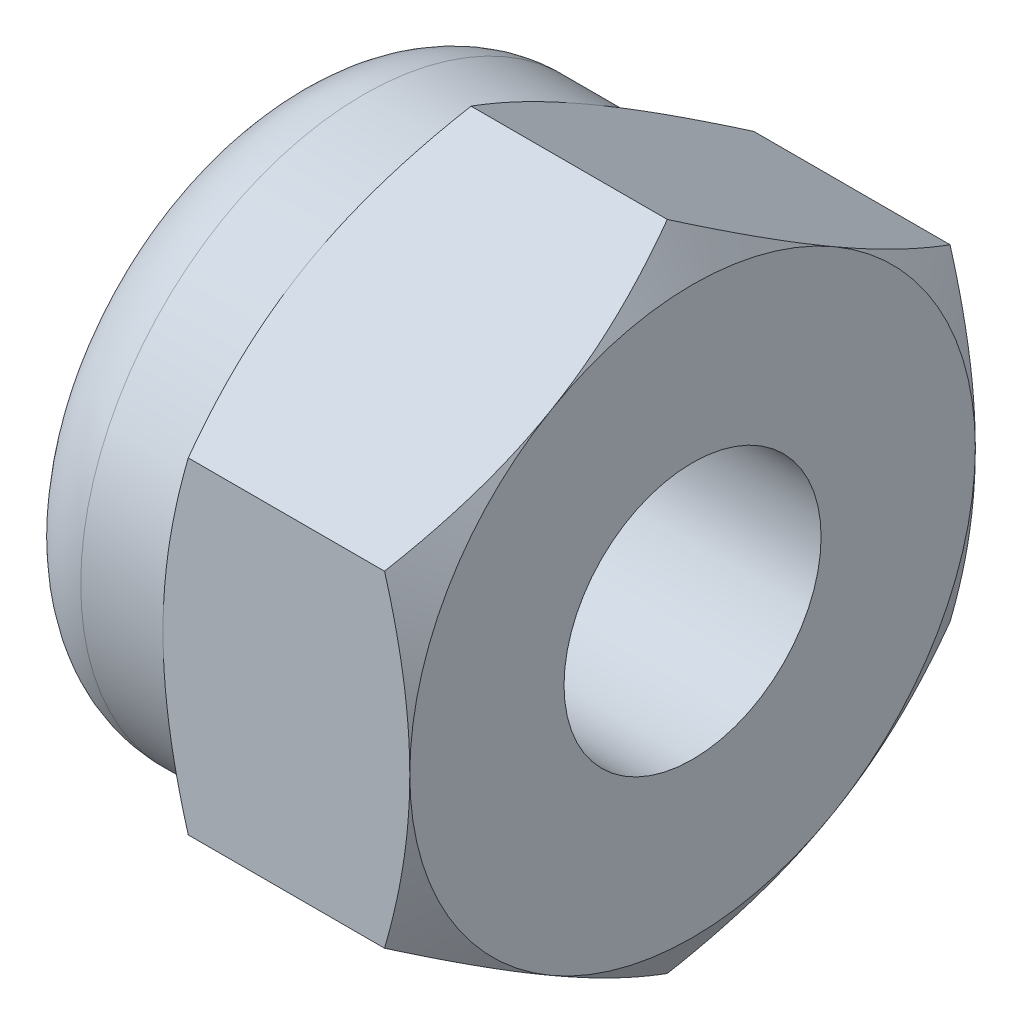
ISO-10303-21;
HEADER;
FILE_DESCRIPTION(('STEP AP214'),'2;1');
FILE_NAME('part.step','',(''),(''),'','','');
FILE_SCHEMA(('AUTOMOTIVE_DESIGN { 1 0 10303 214 1 1 1 1 }'));
ENDSEC;
DATA;
#1=APPLICATION_CONTEXT('core data for automotive mechanical design processes');
#2=APPLICATION_PROTOCOL_DEFINITION('international standard','automotive_design',2000,#1);
#3=PRODUCT_CONTEXT('',#1,'mechanical');
#4=PRODUCT('Part','Part','',(#3));
#5=PRODUCT_RELATED_PRODUCT_CATEGORY('part','',(#4));
#6=PRODUCT_DEFINITION_FORMATION('','',#4);
#7=PRODUCT_DEFINITION_CONTEXT('part definition',#1,'design');
#8=PRODUCT_DEFINITION('design','',#6,#7);
#9=PRODUCT_DEFINITION_SHAPE('','',#8);
#10=(LENGTH_UNIT() NAMED_UNIT(*) SI_UNIT(.MILLI.,.METRE.));
#11=(NAMED_UNIT(*) PLANE_ANGLE_UNIT() SI_UNIT($,.RADIAN.));
#12=(NAMED_UNIT(*) SI_UNIT($,.STERADIAN.) SOLID_ANGLE_UNIT());
#13=UNCERTAINTY_MEASURE_WITH_UNIT(LENGTH_MEASURE(1.E-05),#10,'distance_accuracy_value','');
#14=(GEOMETRIC_REPRESENTATION_CONTEXT(3) GLOBAL_UNCERTAINTY_ASSIGNED_CONTEXT((#13)) GLOBAL_UNIT_ASSIGNED_CONTEXT((#10,
#11,#12)) REPRESENTATION_CONTEXT('',''));
#15=CARTESIAN_POINT('',(0.,0.,0.));
#16=DIRECTION('',(0.,0.,1.));
#17=DIRECTION('',(1.,0.,0.));
#18=AXIS2_PLACEMENT_3D('',#15,#16,#17);
#19=CARTESIAN_POINT('',(-4.,1.58771324027147,-2.75));
#20=DIRECTION('',(0.,0.866025403784439,-0.5));
#21=DIRECTION('',(0.,0.5,0.866025403784439));
#22=AXIS2_PLACEMENT_3D('',#19,#20,#21);
#23=PLANE('',#22);
#24=DIRECTION('',(1.,0.,0.));
#25=VECTOR('',#24,1.);
#26=CARTESIAN_POINT('',(-4.,1.58771324027147,-2.75));
#27=LINE('',#26,#25);
#28=CARTESIAN_POINT('',(-2.15437990693814,1.58771324027148,-2.75));
#29=VERTEX_POINT('',#28);
#30=CARTESIAN_POINT('',(-0.245620093061859,1.58771324027148,-2.75));
#31=VERTEX_POINT('',#30);
#32=EDGE_CURVE('E143',#29,#31,#27,.T.);
#33=ORIENTED_EDGE('',*,*,#32,.F.);
#34=CARTESIAN_POINT('',(-2.15431323663524,1.58759777021763,-2.7502));
#35=CARTESIAN_POINT('',(-2.19461233775074,1.65737010029699,-2.62935077934009));
#36=CARTESIAN_POINT('',(-2.23126309740234,1.72774469983534,-2.50745839737737));
#37=CARTESIAN_POINT('',(-2.2952378170302,1.86971254687003,-2.26156287327211));
#38=CARTESIAN_POINT('',(-2.3225391443255,1.94130831721583,-2.13755536142614));
#39=CARTESIAN_POINT('',(-2.36503825470588,2.08361254889599,-1.89107720202406));
#40=CARTESIAN_POINT('',(-2.38051888137754,2.15429911309865,-1.76864448141258));
#41=CARTESIAN_POINT('',(-2.39900060263006,2.29600490065923,-1.52320285763108));
#42=CARTESIAN_POINT('',(-2.4020170005374,2.36702360884404,-1.40019484676709));
#43=CARTESIAN_POINT('',(-2.39574685457146,2.49972966594897,-1.17034121338921));
#44=CARTESIAN_POINT('',(-2.3879998457233,2.56143686540073,-1.06346120874598));
#45=CARTESIAN_POINT('',(-2.36344481893564,2.68444923614047,-0.850397532665252));
#46=CARTESIAN_POINT('',(-2.34662841034943,2.74575398185008,-0.744214598351112));
#47=CARTESIAN_POINT('',(-2.30458807765404,2.86902004703207,-0.530711510606817));
#48=CARTESIAN_POINT('',(-2.27918591931277,2.93096576264319,-0.423418383857147));
#49=CARTESIAN_POINT('',(-2.22153277416002,3.05393320806134,-0.21043252071595));
#50=CARTESIAN_POINT('',(-2.18929533670102,3.11495651365995,-0.104737054973348));
#51=CARTESIAN_POINT('',(-2.15431323663524,3.17554195059678,0.000200000000000793));
#52=B_SPLINE_CURVE_WITH_KNOTS('',3,(#34,#35,#36,#37,#38,#39,#40,#41,#42,#43,#44,#45,#46,#47,#48,
#49,#50,#51),.UNSPECIFIED.,.F.,.F.,(4,2,2,2,2,2,2,2,4),(0.,0.435912828725887,0.872873557116331,
1.29901931904671,1.72464171213573,2.09526089052937,2.46622354066374,2.84541551798557,
3.22386274754524),.UNSPECIFIED.);
#53=CARTESIAN_POINT('',(-2.4,2.38156986040721,-1.375));
#54=VERTEX_POINT('',#53);
#55=EDGE_CURVE('E263',#29,#54,#52,.T.);
#56=ORIENTED_EDGE('',*,*,#55,.T.);
#57=CARTESIAN_POINT('',(-2.15437990693814,3.17542648054295,0.));
#58=VERTEX_POINT('',#57);
#59=EDGE_CURVE('E257',#54,#58,#52,.T.);
#60=ORIENTED_EDGE('',*,*,#59,.T.);
#61=DIRECTION('',(1.,0.,0.));
#62=VECTOR('',#61,1.);
#63=CARTESIAN_POINT('',(-4.,3.17542648054295,0.));
#64=LINE('',#63,#62);
#65=CARTESIAN_POINT('',(-0.245620093061859,3.17542648054295,0.));
#66=VERTEX_POINT('',#65);
#67=EDGE_CURVE('E150',#58,#66,#64,.T.);
#68=ORIENTED_EDGE('',*,*,#67,.T.);
#69=CARTESIAN_POINT('',(-0.245686763364757,3.17554195059678,0.000200000000000731));
#70=CARTESIAN_POINT('',(-0.20538766224926,3.10576962051743,-0.120649220659906));
#71=CARTESIAN_POINT('',(-0.16873690259766,3.03539502097908,-0.242541602622634));
#72=CARTESIAN_POINT('',(-0.104762182969799,2.89342717394439,-0.488437126727894));
#73=CARTESIAN_POINT('',(-0.0774608556744963,2.82183140359859,-0.612444638573856));
#74=CARTESIAN_POINT('',(-0.0349617452941165,2.67952717191843,-0.858922797975944));
#75=CARTESIAN_POINT('',(-0.0194811186224578,2.60884060771578,-0.981355518587418));
#76=CARTESIAN_POINT('',(-0.000999397369940394,2.46713482015519,-1.22679714236892));
#77=CARTESIAN_POINT('',(0.00201700053740085,2.39611611197038,-1.34980515323291));
#78=CARTESIAN_POINT('',(-0.0042531454285459,2.26341005486545,-1.57965878661079));
#79=CARTESIAN_POINT('',(-0.0120001542767018,2.20170285541369,-1.68653879125402));
#80=CARTESIAN_POINT('',(-0.036555181064354,2.07869048467395,-1.89960246733475));
#81=CARTESIAN_POINT('',(-0.0533715896505691,2.01738573896434,-2.00578540164889));
#82=CARTESIAN_POINT('',(-0.0954119223459546,1.89411967378235,-2.21928848939318));
#83=CARTESIAN_POINT('',(-0.120814080687229,1.83217395817123,-2.32658161614285));
#84=CARTESIAN_POINT('',(-0.178467225839979,1.70920651275308,-2.53956747928405));
#85=CARTESIAN_POINT('',(-0.210704663298979,1.64818320715446,-2.64526294502665));
#86=CARTESIAN_POINT('',(-0.245686763364755,1.58759777021763,-2.7502));
#87=B_SPLINE_CURVE_WITH_KNOTS('',3,(#69,#70,#71,#72,#73,#74,#75,#76,#77,#78,#79,#80,#81,#82,#83,
#84,#85,#86),.UNSPECIFIED.,.F.,.F.,(4,2,2,2,2,2,2,2,4),(0.,0.435912828725888,0.872873557116331,
1.29901931904671,1.72464171213573,2.09526089052937,2.46622354066374,2.84541551798557,
3.22386274754524),.UNSPECIFIED.);
#88=CARTESIAN_POINT('',(0.,2.38156986040721,-1.375));
#89=VERTEX_POINT('',#88);
#90=EDGE_CURVE('E308',#66,#89,#87,.T.);
#91=ORIENTED_EDGE('',*,*,#90,.T.);
#92=EDGE_CURVE('E211',#89,#31,#87,.T.);
#93=ORIENTED_EDGE('',*,*,#92,.T.);
#94=EDGE_LOOP('',(#33,#56,#60,#68,#91,#93));
#95=FACE_BOUND('',#94,.T.);
#96=ADVANCED_FACE('F15',(#95),#23,.T.);
#97=CARTESIAN_POINT('',(-4.,-1.58771324027147,-2.75));
#98=DIRECTION('',(0.,0.,-1.));
#99=DIRECTION('',(0.,1.,0.));
#100=AXIS2_PLACEMENT_3D('',#97,#98,#99);
#101=PLANE('',#100);
#102=DIRECTION('',(1.,0.,0.));
#103=VECTOR('',#102,1.);
#104=CARTESIAN_POINT('',(-4.,-1.58771324027147,-2.75));
#105=LINE('',#104,#103);
#106=CARTESIAN_POINT('',(-2.15437990693814,-1.58771324027147,-2.75));
#107=VERTEX_POINT('',#106);
#108=CARTESIAN_POINT('',(-0.245620093061859,-1.58771324027147,-2.75));
#109=VERTEX_POINT('',#108);
#110=EDGE_CURVE('E140',#107,#109,#105,.T.);
#111=ORIENTED_EDGE('',*,*,#110,.F.);
#112=CARTESIAN_POINT('',(-1.08405108591023,-4.21085047466775,-2.75));
#113=CARTESIAN_POINT('',(-1.14239960966293,-4.09010989011094,-2.75));
#114=CARTESIAN_POINT('',(-1.20016810098764,-3.96908383499852,-2.75));
#115=CARTESIAN_POINT('',(-1.31421356815425,-3.72630642982621,-2.75));
#116=CARTESIAN_POINT('',(-1.37049028575681,-3.60455495860072,-2.75));
#117=CARTESIAN_POINT('',(-1.48151722378068,-3.35951467553998,-2.75));
#118=CARTESIAN_POINT('',(-1.53625686571546,-3.23622105325521,-2.75));
#119=CARTESIAN_POINT('',(-1.64338494984909,-2.98862044341193,-2.75));
#120=CARTESIAN_POINT('',(-1.6957735146052,-2.86431350907558,-2.75));
#121=CARTESIAN_POINT('',(-1.79819621428787,-2.61294539628322,-2.75));
#122=CARTESIAN_POINT('',(-1.84819354800061,-2.48586914007059,-2.75));
#123=CARTESIAN_POINT('',(-1.94427243496487,-2.23021775204037,-2.75));
#124=CARTESIAN_POINT('',(-1.99035355255758,-2.1016424552668,-2.75));
#125=CARTESIAN_POINT('',(-2.07736182002803,-1.84305250936245,-2.75));
#126=CARTESIAN_POINT('',(-2.11829992722097,-1.7130415851225,-2.75));
#127=CARTESIAN_POINT('',(-2.19369263632952,-1.45117146066374,-2.75));
#128=CARTESIAN_POINT('',(-2.22814928856133,-1.31931285916158,-2.75));
#129=CARTESIAN_POINT('',(-2.28890631402182,-1.05365730058872,-2.75));
#130=CARTESIAN_POINT('',(-2.31520451432338,-0.91985983703522,-2.75));
#131=CARTESIAN_POINT('',(-2.35787397795957,-0.650651771588404,-2.75));
#132=CARTESIAN_POINT('',(-2.374245232524,-0.515241168270029,-2.75));
#133=CARTESIAN_POINT('',(-2.39561251963743,-0.244372959827891,-2.75));
#134=CARTESIAN_POINT('',(-2.40068056630442,-0.108921183336606,-2.75));
#135=CARTESIAN_POINT('',(-2.39917219036022,0.161887520872984,-2.75));
#136=CARTESIAN_POINT('',(-2.39259879041321,0.297244464085856,-2.75));
#137=CARTESIAN_POINT('',(-2.37189580522956,0.528386033126789,-2.75));
#138=CARTESIAN_POINT('',(-2.36046228070884,0.624425663637137,-2.75));
#139=CARTESIAN_POINT('',(-2.33247817430537,0.815763046773997,-2.75));
#140=CARTESIAN_POINT('',(-2.31592678540798,0.911060679966733,-2.75));
#141=CARTESIAN_POINT('',(-2.25946447516098,1.19576289915276,-2.75));
#142=CARTESIAN_POINT('',(-2.21275994778995,1.38383299011474,-2.75));
#143=CARTESIAN_POINT('',(-2.13220726693515,1.66525127863567,-2.75));
#144=CARTESIAN_POINT('',(-2.10319641445221,1.76006636738015,-2.75));
#145=CARTESIAN_POINT('',(-2.04230407192395,1.9487069300056,-2.75));
#146=CARTESIAN_POINT('',(-2.01042456185307,2.04253303727579,-2.75));
#147=CARTESIAN_POINT('',(-1.94445826089924,2.22880328617382,-2.75));
#148=CARTESIAN_POINT('',(-1.91038490408282,2.32125223383933,-2.75));
#149=CARTESIAN_POINT('',(-1.84023827062062,2.50543284907629,-2.75));
#150=CARTESIAN_POINT('',(-1.80416418567468,2.59716420940991,-2.75));
#151=CARTESIAN_POINT('',(-1.76728717077665,2.68856388993767,-2.75));
#152=B_SPLINE_CURVE_WITH_KNOTS('',3,(#112,#113,#114,#115,#116,#117,#118,#119,#120,#121,#122,
#123,#124,#125,#126,#127,#128,#129,#130,#131,#132,#133,#134,#135,#136,#137,#138,#139,#140,#141,
#142,#143,#144,#145,#146,#147,#148,#149,#150,#151),.UNSPECIFIED.,.F.,.F.,(4,2,2,2,2,2,2,2,2,2,2,
2,2,2,2,2,2,2,2,4),(0.,0.402305724628122,0.804680643080821,1.20935819137344,1.61401462001939,
2.02363897413607,2.43330883735974,2.8420905276564,3.25074268740349,3.6595035945605,
4.06826486284692,4.47441433252271,4.88045836225495,5.17047019471949,5.46052778127857,
6.04107464708557,6.33851326493238,6.63574813987144,6.93130997697813,7.2269921043048),.UNSPECIFIED.);
#153=CARTESIAN_POINT('',(-2.4,0.,-2.75));
#154=VERTEX_POINT('',#153);
#155=EDGE_CURVE('E133',#107,#154,#152,.T.);
#156=ORIENTED_EDGE('',*,*,#155,.T.);
#157=EDGE_CURVE('E226',#154,#29,#152,.T.);
#158=ORIENTED_EDGE('',*,*,#157,.T.);
#159=ORIENTED_EDGE('',*,*,#32,.T.);
#160=CARTESIAN_POINT('',(-1.31594891408976,-4.21085047466775,-2.75));
#161=CARTESIAN_POINT('',(-1.25760039033706,-4.09010989011095,-2.75));
#162=CARTESIAN_POINT('',(-1.19983189901234,-3.96908383499853,-2.75));
#163=CARTESIAN_POINT('',(-1.08578643184574,-3.72630642982622,-2.75));
#164=CARTESIAN_POINT('',(-1.02950971424317,-3.60455495860072,-2.75));
#165=CARTESIAN_POINT('',(-0.918482776219309,-3.35951467553998,-2.75));
#166=CARTESIAN_POINT('',(-0.863743134284528,-3.23622105325521,-2.75));
#167=CARTESIAN_POINT('',(-0.756615050150899,-2.98862044341193,-2.75));
#168=CARTESIAN_POINT('',(-0.704226485394789,-2.86431350907558,-2.75));
#169=CARTESIAN_POINT('',(-0.601803785712119,-2.61294539628323,-2.75));
#170=CARTESIAN_POINT('',(-0.551806451999385,-2.48586914007059,-2.75));
#171=CARTESIAN_POINT('',(-0.455727565035127,-2.23021775204037,-2.75));
#172=CARTESIAN_POINT('',(-0.409646447442418,-2.1016424552668,-2.75));
#173=CARTESIAN_POINT('',(-0.322638179971965,-1.84305250936246,-2.75));
#174=CARTESIAN_POINT('',(-0.281700072779022,-1.71304158512251,-2.75));
#175=CARTESIAN_POINT('',(-0.206307363670478,-1.45117146066374,-2.75));
#176=CARTESIAN_POINT('',(-0.171850711438669,-1.31931285916159,-2.75));
#177=CARTESIAN_POINT('',(-0.11109368597818,-1.05365730058872,-2.75));
#178=CARTESIAN_POINT('',(-0.0847954856766144,-0.919859837035222,-2.75));
#179=CARTESIAN_POINT('',(-0.0421260220404225,-0.650651771588406,-2.75));
#180=CARTESIAN_POINT('',(-0.0257547674760023,-0.515241168270031,-2.75));
#181=CARTESIAN_POINT('',(-0.00438748036256619,-0.244372959827892,-2.75));
#182=CARTESIAN_POINT('',(0.000680566304423578,-0.108921183336606,-2.75));
#183=CARTESIAN_POINT('',(-0.000827809639779235,0.161887520872983,-2.75));
#184=CARTESIAN_POINT('',(-0.00740120958678831,0.297244464085855,-2.75));
#185=CARTESIAN_POINT('',(-0.0281041947704377,0.528386033126789,-2.75));
#186=CARTESIAN_POINT('',(-0.0395377192911541,0.624425663637137,-2.75));
#187=CARTESIAN_POINT('',(-0.0675218256946252,0.815763046773999,-2.75));
#188=CARTESIAN_POINT('',(-0.0840732145920178,0.911060679966734,-2.75));
#189=CARTESIAN_POINT('',(-0.140535524839017,1.19576289915276,-2.75));
#190=CARTESIAN_POINT('',(-0.187240052210046,1.38383299011475,-2.75));
#191=CARTESIAN_POINT('',(-0.267792733064847,1.66525127863567,-2.75));
#192=CARTESIAN_POINT('',(-0.29680358554779,1.76006636738016,-2.75));
#193=CARTESIAN_POINT('',(-0.357695928076048,1.94870693000561,-2.75));
#194=CARTESIAN_POINT('',(-0.389575438146922,2.04253303727579,-2.75));
#195=CARTESIAN_POINT('',(-0.455541739100759,2.22880328617383,-2.75));
#196=CARTESIAN_POINT('',(-0.489615095917172,2.32125223383934,-2.75));
#197=CARTESIAN_POINT('',(-0.559761729379378,2.5054328490763,-2.75));
#198=CARTESIAN_POINT('',(-0.595835814325318,2.59716420940992,-2.75));
#199=CARTESIAN_POINT('',(-0.632712829223347,2.68856388993767,-2.75));
#200=B_SPLINE_CURVE_WITH_KNOTS('',3,(#160,#161,#162,#163,#164,#165,#166,#167,#168,#169,#170,
#171,#172,#173,#174,#175,#176,#177,#178,#179,#180,#181,#182,#183,#184,#185,#186,#187,#188,#189,
#190,#191,#192,#193,#194,#195,#196,#197,#198,#199),.UNSPECIFIED.,.F.,.F.,(4,2,2,2,2,2,2,2,2,2,2,
2,2,2,2,2,2,2,2,4),(0.,0.402305724628121,0.804680643080821,1.20935819137344,1.61401462001939,
2.02363897413607,2.43330883735973,2.84209052765639,3.25074268740349,3.6595035945605,
4.06826486284692,4.47441433252271,4.88045836225495,5.17047019471949,5.46052778127857,
6.04107464708557,6.33851326493238,6.63574813987144,6.93130997697814,7.22699210430481),.UNSPECIFIED.);
#201=CARTESIAN_POINT('',(0.,0.,-2.75));
#202=VERTEX_POINT('',#201);
#203=EDGE_CURVE('E209',#31,#202,#200,.F.);
#204=ORIENTED_EDGE('',*,*,#203,.T.);
#205=EDGE_CURVE('E202',#202,#109,#200,.F.);
#206=ORIENTED_EDGE('',*,*,#205,.T.);
#207=EDGE_LOOP('',(#111,#156,#158,#159,#204,#206));
#208=FACE_BOUND('',#207,.T.);
#209=ADVANCED_FACE('F217',(#208),#101,.T.);
#210=CARTESIAN_POINT('',(-4.,-3.17542648054294,0.));
#211=DIRECTION('',(0.,-0.866025403784439,-0.5));
#212=DIRECTION('',(0.,0.5,-0.866025403784439));
#213=AXIS2_PLACEMENT_3D('',#210,#211,#212);
#214=PLANE('',#213);
#215=DIRECTION('',(1.,0.,0.));
#216=VECTOR('',#215,1.);
#217=CARTESIAN_POINT('',(-4.,-3.17542648054294,0.));
#218=LINE('',#217,#216);
#219=CARTESIAN_POINT('',(-2.15437990693814,-3.17542648054295,0.));
#220=VERTEX_POINT('',#219);
#221=CARTESIAN_POINT('',(-0.245620093061859,-3.17542648054295,0.));
#222=VERTEX_POINT('',#221);
#223=EDGE_CURVE('E130',#220,#222,#218,.T.);
#224=ORIENTED_EDGE('',*,*,#223,.F.);
#225=CARTESIAN_POINT('',(-2.15431323663524,-3.17554195059678,0.000200000000001049));
#226=CARTESIAN_POINT('',(-2.19461233775074,-3.10576962051743,-0.120649220659905));
#227=CARTESIAN_POINT('',(-2.23126309740234,-3.03539502097908,-0.242541602622632));
#228=CARTESIAN_POINT('',(-2.2952378170302,-2.89342717394438,-0.488437126727891));
#229=CARTESIAN_POINT('',(-2.3225391443255,-2.82183140359858,-0.612444638573853));
#230=CARTESIAN_POINT('',(-2.36503825470588,-2.67952717191842,-0.858922797975941));
#231=CARTESIAN_POINT('',(-2.38051888137754,-2.60884060771577,-0.981355518587415));
#232=CARTESIAN_POINT('',(-2.39900060263006,-2.46713482015518,-1.22679714236891));
#233=CARTESIAN_POINT('',(-2.4020170005374,-2.39611611197038,-1.34980515323291));
#234=CARTESIAN_POINT('',(-2.39574685457146,-2.26341005486544,-1.57965878661079));
#235=CARTESIAN_POINT('',(-2.3879998457233,-2.20170285541369,-1.68653879125402));
#236=CARTESIAN_POINT('',(-2.36344481893565,-2.07869048467395,-1.89960246733475));
#237=CARTESIAN_POINT('',(-2.34662841034943,-2.01738573896433,-2.00578540164889));
#238=CARTESIAN_POINT('',(-2.30458807765405,-1.89411967378235,-2.21928848939318));
#239=CARTESIAN_POINT('',(-2.27918591931277,-1.83217395817123,-2.32658161614285));
#240=CARTESIAN_POINT('',(-2.22153277416002,-1.70920651275308,-2.53956747928405));
#241=CARTESIAN_POINT('',(-2.18929533670102,-1.64818320715446,-2.64526294502665));
#242=CARTESIAN_POINT('',(-2.15431323663524,-1.58759777021763,-2.7502));
#243=B_SPLINE_CURVE_WITH_KNOTS('',3,(#225,#226,#227,#228,#229,#230,#231,#232,#233,#234,#235,
#236,#237,#238,#239,#240,#241,#242),.UNSPECIFIED.,.F.,.F.,(4,2,2,2,2,2,2,2,4),(0.,
0.435912828725887,0.872873557116331,1.29901931904671,1.72464171213573,2.09526089052937,
2.46622354066374,2.84541551798557,3.22386274754524),.UNSPECIFIED.);
#244=CARTESIAN_POINT('',(-2.4,-2.38156986040721,-1.375));
#245=VERTEX_POINT('',#244);
#246=EDGE_CURVE('E112',#220,#245,#243,.T.);
#247=ORIENTED_EDGE('',*,*,#246,.T.);
#248=EDGE_CURVE('E123',#245,#107,#243,.T.);
#249=ORIENTED_EDGE('',*,*,#248,.T.);
#250=ORIENTED_EDGE('',*,*,#110,.T.);
#251=CARTESIAN_POINT('',(-0.245686763364755,-1.58759777021763,-2.7502));
#252=CARTESIAN_POINT('',(-0.205387662249258,-1.65737010029699,-2.62935077934009));
#253=CARTESIAN_POINT('',(-0.168736902597657,-1.72774469983533,-2.50745839737736));
#254=CARTESIAN_POINT('',(-0.104762182969797,-1.86971254687003,-2.26156287327211));
#255=CARTESIAN_POINT('',(-0.0774608556744937,-1.94130831721583,-2.13755536142614));
#256=CARTESIAN_POINT('',(-0.0349617452941134,-2.08361254889599,-1.89107720202406));
#257=CARTESIAN_POINT('',(-0.019481118622454,-2.15429911309864,-1.76864448141258));
#258=CARTESIAN_POINT('',(-0.00099939736993808,-2.29600490065923,-1.52320285763108));
#259=CARTESIAN_POINT('',(0.0020170005374008,-2.36702360884404,-1.40019484676709));
#260=CARTESIAN_POINT('',(-0.00425314542854584,-2.49972966594897,-1.17034121338921));
#261=CARTESIAN_POINT('',(-0.0120001542766998,-2.56143686540072,-1.06346120874598));
#262=CARTESIAN_POINT('',(-0.0365551810643508,-2.68444923614046,-0.850397532665249));
#263=CARTESIAN_POINT('',(-0.0533715896505665,-2.74575398185008,-0.744214598351109));
#264=CARTESIAN_POINT('',(-0.0954119223459523,-2.86902004703206,-0.530711510606815));
#265=CARTESIAN_POINT('',(-0.120814080687226,-2.93096576264318,-0.423418383857143));
#266=CARTESIAN_POINT('',(-0.178467225839977,-3.05393320806134,-0.210432520715947));
#267=CARTESIAN_POINT('',(-0.210704663298977,-3.11495651365995,-0.104737054973346));
#268=CARTESIAN_POINT('',(-0.245686763364756,-3.17554195059678,0.000200000000000986));
#269=B_SPLINE_CURVE_WITH_KNOTS('',3,(#251,#252,#253,#254,#255,#256,#257,#258,#259,#260,#261,
#262,#263,#264,#265,#266,#267,#268),.UNSPECIFIED.,.F.,.F.,(4,2,2,2,2,2,2,2,4),(0.,
0.435912828725888,0.872873557116331,1.29901931904671,1.72464171213573,2.09526089052937,
2.46622354066374,2.84541551798557,3.22386274754524),.UNSPECIFIED.);
#270=CARTESIAN_POINT('',(0.,-2.38156986040721,-1.375));
#271=VERTEX_POINT('',#270);
#272=EDGE_CURVE('E210',#109,#271,#269,.T.);
#273=ORIENTED_EDGE('',*,*,#272,.T.);
#274=EDGE_CURVE('E139',#271,#222,#269,.T.);
#275=ORIENTED_EDGE('',*,*,#274,.T.);
#276=EDGE_LOOP('',(#224,#247,#249,#250,#273,#275));
#277=FACE_BOUND('',#276,.T.);
#278=ADVANCED_FACE('F136',(#277),#214,.T.);
#279=CARTESIAN_POINT('',(-4.,-1.58771324027147,2.75));
#280=DIRECTION('',(0.,-0.866025403784439,0.5));
#281=DIRECTION('',(0.,-0.5,-0.866025403784439));
#282=AXIS2_PLACEMENT_3D('',#279,#280,#281);
#283=PLANE('',#282);
#284=DIRECTION('',(1.,0.,0.));
#285=VECTOR('',#284,1.);
#286=CARTESIAN_POINT('',(-4.,-1.58771324027147,2.75));
#287=LINE('',#286,#285);
#288=CARTESIAN_POINT('',(-2.15437990693814,-1.58771324027147,2.75));
#289=VERTEX_POINT('',#288);
#290=CARTESIAN_POINT('',(-0.245620093061859,-1.58771324027147,2.75));
#291=VERTEX_POINT('',#290);
#292=EDGE_CURVE('E141',#289,#291,#287,.T.);
#293=ORIENTED_EDGE('',*,*,#292,.F.);
#294=CARTESIAN_POINT('',(-2.15431323663524,-1.58759777021763,2.7502));
#295=CARTESIAN_POINT('',(-2.19461233775074,-1.65737010029699,2.62935077934009));
#296=CARTESIAN_POINT('',(-2.23126309740234,-1.72774469983533,2.50745839737736));
#297=CARTESIAN_POINT('',(-2.2952378170302,-1.86971254687003,2.26156287327211));
#298=CARTESIAN_POINT('',(-2.3225391443255,-1.94130831721583,2.13755536142614));
#299=CARTESIAN_POINT('',(-2.36503825470588,-2.08361254889599,1.89107720202406));
#300=CARTESIAN_POINT('',(-2.38051888137754,-2.15429911309864,1.76864448141258));
#301=CARTESIAN_POINT('',(-2.39900060263006,-2.29600490065923,1.52320285763108));
#302=CARTESIAN_POINT('',(-2.4020170005374,-2.36702360884404,1.40019484676709));
#303=CARTESIAN_POINT('',(-2.39574685457146,-2.49972966594897,1.17034121338921));
#304=CARTESIAN_POINT('',(-2.3879998457233,-2.56143686540072,1.06346120874598));
#305=CARTESIAN_POINT('',(-2.36344481893565,-2.68444923614046,0.85039753266525));
#306=CARTESIAN_POINT('',(-2.34662841034943,-2.74575398185008,0.744214598351111));
#307=CARTESIAN_POINT('',(-2.30458807765404,-2.86902004703206,0.530711510606817));
#308=CARTESIAN_POINT('',(-2.27918591931277,-2.93096576264318,0.423418383857145));
#309=CARTESIAN_POINT('',(-2.22153277416002,-3.05393320806134,0.210432520715949));
#310=CARTESIAN_POINT('',(-2.18929533670102,-3.11495651365995,0.104737054973348));
#311=CARTESIAN_POINT('',(-2.15431323663524,-3.17554195059678,-0.000199999999999301));
#312=B_SPLINE_CURVE_WITH_KNOTS('',3,(#294,#295,#296,#297,#298,#299,#300,#301,#302,#303,#304,
#305,#306,#307,#308,#309,#310,#311),.UNSPECIFIED.,.F.,.F.,(4,2,2,2,2,2,2,2,4),(0.,
0.435912828725887,0.872873557116331,1.29901931904671,1.72464171213573,2.09526089052937,
2.46622354066374,2.84541551798557,3.22386274754524),.UNSPECIFIED.);
#313=CARTESIAN_POINT('',(-2.4,-2.38156986040721,1.375));
#314=VERTEX_POINT('',#313);
#315=EDGE_CURVE('E132',#289,#314,#312,.T.);
#316=ORIENTED_EDGE('',*,*,#315,.T.);
#317=EDGE_CURVE('E115',#314,#220,#312,.T.);
#318=ORIENTED_EDGE('',*,*,#317,.T.);
#319=ORIENTED_EDGE('',*,*,#223,.T.);
#320=CARTESIAN_POINT('',(-0.245686763364756,-3.17554195059678,-0.000199999999998929));
#321=CARTESIAN_POINT('',(-0.205387662249258,-3.10576962051743,0.120649220659906));
#322=CARTESIAN_POINT('',(-0.168736902597657,-3.03539502097908,0.242541602622633));
#323=CARTESIAN_POINT('',(-0.104762182969797,-2.89342717394438,0.488437126727892));
#324=CARTESIAN_POINT('',(-0.0774608556744942,-2.82183140359858,0.612444638573854));
#325=CARTESIAN_POINT('',(-0.0349617452941139,-2.67952717191842,0.858922797975942));
#326=CARTESIAN_POINT('',(-0.0194811186224546,-2.60884060771577,0.981355518587415));
#327=CARTESIAN_POINT('',(-0.000999397369938503,-2.46713482015519,1.22679714236891));
#328=CARTESIAN_POINT('',(0.00201700053740077,-2.39611611197038,1.34980515323291));
#329=CARTESIAN_POINT('',(-0.00425314542854591,-2.26341005486544,1.57965878661079));
#330=CARTESIAN_POINT('',(-0.0120001542767002,-2.20170285541369,1.68653879125402));
#331=CARTESIAN_POINT('',(-0.0365551810643512,-2.07869048467395,1.89960246733475));
#332=CARTESIAN_POINT('',(-0.0533715896505667,-2.01738573896433,2.00578540164889));
#333=CARTESIAN_POINT('',(-0.0954119223459522,-1.89411967378235,2.21928848939318));
#334=CARTESIAN_POINT('',(-0.120814080687226,-1.83217395817123,2.32658161614285));
#335=CARTESIAN_POINT('',(-0.178467225839977,-1.70920651275308,2.53956747928405));
#336=CARTESIAN_POINT('',(-0.210704663298978,-1.64818320715446,2.64526294502665));
#337=CARTESIAN_POINT('',(-0.245686763364757,-1.58759777021763,2.7502));
#338=B_SPLINE_CURVE_WITH_KNOTS('',3,(#320,#321,#322,#323,#324,#325,#326,#327,#328,#329,#330,
#331,#332,#333,#334,#335,#336,#337),.UNSPECIFIED.,.F.,.F.,(4,2,2,2,2,2,2,2,4),(0.,
0.435912828725888,0.87287355711633,1.29901931904671,1.72464171213573,2.09526089052937,
2.46622354066374,2.84541551798557,3.22386274754524),.UNSPECIFIED.);
#339=CARTESIAN_POINT('',(0.,-2.38156986040721,1.375));
#340=VERTEX_POINT('',#339);
#341=EDGE_CURVE('E281',#222,#340,#338,.T.);
#342=ORIENTED_EDGE('',*,*,#341,.T.);
#343=EDGE_CURVE('E189',#340,#291,#338,.T.);
#344=ORIENTED_EDGE('',*,*,#343,.T.);
#345=EDGE_LOOP('',(#293,#316,#318,#319,#342,#344));
#346=FACE_BOUND('',#345,.T.);
#347=ADVANCED_FACE('F128',(#346),#283,.T.);
#348=CARTESIAN_POINT('',(-4.,1.58771324027147,2.75));
#349=DIRECTION('',(0.,0.,1.));
#350=DIRECTION('',(1.,0.,0.));
#351=AXIS2_PLACEMENT_3D('',#348,#349,#350);
#352=PLANE('',#351);
#353=DIRECTION('',(1.,0.,0.));
#354=VECTOR('',#353,1.);
#355=CARTESIAN_POINT('',(-4.,1.58771324027147,2.75));
#356=LINE('',#355,#354);
#357=CARTESIAN_POINT('',(-2.15437990693814,1.58771324027147,2.75));
#358=VERTEX_POINT('',#357);
#359=CARTESIAN_POINT('',(-0.245620093061859,1.58771324027147,2.75));
#360=VERTEX_POINT('',#359);
#361=EDGE_CURVE('E145',#358,#360,#356,.T.);
#362=ORIENTED_EDGE('',*,*,#361,.F.);
#363=CARTESIAN_POINT('',(-1.08405156039708,-4.21084949309675,2.75));
#364=CARTESIAN_POINT('',(-1.14240006384777,-4.09010894214089,2.75));
#365=CARTESIAN_POINT('',(-1.20016853488242,-3.96908292065508,2.75));
#366=CARTESIAN_POINT('',(-1.31421396157696,-3.72630558284843,2.75));
#367=CARTESIAN_POINT('',(-1.37049065899754,-3.60455414536199,2.75));
#368=CARTESIAN_POINT('',(-1.48151755664725,-3.35951393034354,2.75));
#369=CARTESIAN_POINT('',(-1.53625717839417,-3.23622034236436,2.75));
#370=CARTESIAN_POINT('',(-1.64338522252355,-2.98861980138743,2.75));
#371=CARTESIAN_POINT('',(-1.69577376746324,-2.86431290161181,2.75));
#372=CARTESIAN_POINT('',(-1.79819642785388,-2.61294485887171,2.75));
#373=CARTESIAN_POINT('',(-1.84819374210161,-2.48586863815654,2.75));
#374=CARTESIAN_POINT('',(-1.9442725912154,-2.2302173217154,2.75));
#375=CARTESIAN_POINT('',(-1.99035369042303,-2.10164206103363,2.75));
#376=CARTESIAN_POINT('',(-2.07736192295377,-1.84305218799467,2.75));
#377=CARTESIAN_POINT('',(-2.11830001358611,-1.71304130052583,2.75));
#378=CARTESIAN_POINT('',(-2.19369269237565,-1.45117125062147,2.75));
#379=CARTESIAN_POINT('',(-2.22814933084724,-1.31931268690202,2.75));
#380=CARTESIAN_POINT('',(-2.2889063284691,-1.05365722480012,2.75));
#381=CARTESIAN_POINT('',(-2.31520451590488,-0.91985982021759,2.75));
#382=CARTESIAN_POINT('',(-2.35787396280339,-0.650651874037379,2.75));
#383=CARTESIAN_POINT('',(-2.37424521348946,-0.515241331013593,2.75));
#384=CARTESIAN_POINT('',(-2.39561250345976,-0.24437324286921,2.75));
#385=CARTESIAN_POINT('',(-2.40068055677322,-0.108921526377132,2.75));
#386=CARTESIAN_POINT('',(-2.39917220436733,0.161887058855135,2.75));
#387=CARTESIAN_POINT('',(-2.39259882131445,0.297243943089641,2.75));
#388=CARTESIAN_POINT('',(-2.37189586995316,0.528385436717544,2.75));
#389=CARTESIAN_POINT('',(-2.36046235896981,0.624425050137504,2.75));
#390=CARTESIAN_POINT('',(-2.33247828038665,0.81576239981155,2.75));
#391=CARTESIAN_POINT('',(-2.31592690577232,0.911060016631974,2.75));
#392=CARTESIAN_POINT('',(-2.25946463872171,1.19576218748918,2.75));
#393=CARTESIAN_POINT('',(-2.2127601405827,1.38383224738498,2.75));
#394=CARTESIAN_POINT('',(-2.13220750296942,1.66525048947487,2.75));
#395=CARTESIAN_POINT('',(-2.10319666500449,1.7600655624856,2.75));
#396=CARTESIAN_POINT('',(-2.04230435109341,1.94870609382218,2.75));
#397=CARTESIAN_POINT('',(-2.01042485512149,2.04253218553699,2.75));
#398=CARTESIAN_POINT('',(-1.94445858181354,2.22880240354988,2.75));
#399=CARTESIAN_POINT('',(-1.91038523854446,2.32125133588455,2.75));
#400=CARTESIAN_POINT('',(-1.84023863176888,2.50543192042632,2.75));
#401=CARTESIAN_POINT('',(-1.80416455996267,2.59716326539583,2.75));
#402=CARTESIAN_POINT('',(-1.76728755800251,2.6885629305335,2.75));
#403=B_SPLINE_CURVE_WITH_KNOTS('',3,(#363,#364,#365,#366,#367,#368,#369,#370,#371,#372,#373,
#374,#375,#376,#377,#378,#379,#380,#381,#382,#383,#384,#385,#386,#387,#388,#389,#390,#391,#392,
#393,#394,#395,#396,#397,#398,#399,#400,#401,#402),.UNSPECIFIED.,.F.,.F.,(4,2,2,2,2,2,2,2,2,2,2,
2,2,2,2,2,2,2,2,4),(0.,0.402305607365935,0.804680408536995,1.20935783819118,1.61401414820818,
2.02363838185769,2.43330812457348,2.842089694796,3.25074173456635,3.65950246109142,
4.06826354901183,4.47441284024649,4.88045669141171,5.17046846817545,5.46052599902452,
6.04107275309884,6.33851131304663,6.63574613017457,6.93130791005795,7.22698998004826),.UNSPECIFIED.);
#404=CARTESIAN_POINT('',(-2.4,0.,2.75));
#405=VERTEX_POINT('',#404);
#406=EDGE_CURVE('E35',#358,#405,#403,.F.);
#407=ORIENTED_EDGE('',*,*,#406,.T.);
#408=EDGE_CURVE('E267',#405,#289,#403,.F.);
#409=ORIENTED_EDGE('',*,*,#408,.T.);
#410=ORIENTED_EDGE('',*,*,#292,.T.);
#411=CARTESIAN_POINT('',(-1.31594843960292,-4.21084949309675,2.75));
#412=CARTESIAN_POINT('',(-1.25759993615222,-4.0901089421409,2.75));
#413=CARTESIAN_POINT('',(-1.19983146511756,-3.96908292065509,2.75));
#414=CARTESIAN_POINT('',(-1.08578603842303,-3.72630558284843,2.75));
#415=CARTESIAN_POINT('',(-1.02950934100245,-3.604554145362,2.75));
#416=CARTESIAN_POINT('',(-0.918482443352739,-3.35951393034354,2.75));
#417=CARTESIAN_POINT('',(-0.86374282160582,-3.23622034236436,2.75));
#418=CARTESIAN_POINT('',(-0.756614777476438,-2.98861980138743,2.75));
#419=CARTESIAN_POINT('',(-0.704226232536748,-2.86431290161182,2.75));
#420=CARTESIAN_POINT('',(-0.60180357214611,-2.61294485887172,2.75));
#421=CARTESIAN_POINT('',(-0.551806257898381,-2.48586863815654,2.75));
#422=CARTESIAN_POINT('',(-0.45572740878459,-2.2302173217154,2.75));
#423=CARTESIAN_POINT('',(-0.409646309576962,-2.10164206103363,2.75));
#424=CARTESIAN_POINT('',(-0.322638077046223,-1.84305218799467,2.75));
#425=CARTESIAN_POINT('',(-0.28169998641388,-1.71304130052583,2.75));
#426=CARTESIAN_POINT('',(-0.206307307624343,-1.45117125062147,2.75));
#427=CARTESIAN_POINT('',(-0.171850669152763,-1.31931268690202,2.75));
#428=CARTESIAN_POINT('',(-0.111093671530901,-1.05365722480012,2.75));
#429=CARTESIAN_POINT('',(-0.0847954840951182,-0.91985982021759,2.75));
#430=CARTESIAN_POINT('',(-0.0421260371966082,-0.65065187403738,2.75));
#431=CARTESIAN_POINT('',(-0.0257547865105409,-0.515241331013594,2.75));
#432=CARTESIAN_POINT('',(-0.00438749654023574,-0.244373242869211,2.75));
#433=CARTESIAN_POINT('',(0.000680556773218038,-0.108921526377133,2.75));
#434=CARTESIAN_POINT('',(-0.000827795632670779,0.161887058855134,2.75));
#435=CARTESIAN_POINT('',(-0.00740117868555373,0.29724394308964,2.75));
#436=CARTESIAN_POINT('',(-0.0281041300468432,0.528385436717544,2.75));
#437=CARTESIAN_POINT('',(-0.0395376410301867,0.624425050137505,2.75));
#438=CARTESIAN_POINT('',(-0.0675217196133491,0.815762399811552,2.75));
#439=CARTESIAN_POINT('',(-0.0840730942276809,0.911060016631977,2.75));
#440=CARTESIAN_POINT('',(-0.140535361278284,1.19576218748918,2.75));
#441=CARTESIAN_POINT('',(-0.187239859417294,1.38383224738499,2.75));
#442=CARTESIAN_POINT('',(-0.26779249703058,1.66525048947488,2.75));
#443=CARTESIAN_POINT('',(-0.296803334995503,1.76006556248561,2.75));
#444=CARTESIAN_POINT('',(-0.357695648906591,1.94870609382219,2.75));
#445=CARTESIAN_POINT('',(-0.389575144878507,2.04253218553699,2.75));
#446=CARTESIAN_POINT('',(-0.455541418186453,2.22880240354988,2.75));
#447=CARTESIAN_POINT('',(-0.489614761455538,2.32125133588456,2.75));
#448=CARTESIAN_POINT('',(-0.559761368231116,2.50543192042633,2.75));
#449=CARTESIAN_POINT('',(-0.595835440037325,2.59716326539584,2.75));
#450=CARTESIAN_POINT('',(-0.632712441997493,2.68856293053351,2.75));
#451=B_SPLINE_CURVE_WITH_KNOTS('',3,(#411,#412,#413,#414,#415,#416,#417,#418,#419,#420,#421,
#422,#423,#424,#425,#426,#427,#428,#429,#430,#431,#432,#433,#434,#435,#436,#437,#438,#439,#440,
#441,#442,#443,#444,#445,#446,#447,#448,#449,#450),.UNSPECIFIED.,.F.,.F.,(4,2,2,2,2,2,2,2,2,2,2,
2,2,2,2,2,2,2,2,4),(0.,0.402305607365935,0.804680408536995,1.20935783819118,1.61401414820818,
2.02363838185769,2.43330812457348,2.842089694796,3.25074173456635,3.65950246109143,
4.06826354901183,4.47441284024649,4.88045669141171,5.17046846817545,5.46052599902452,
6.04107275309885,6.33851131304664,6.63574613017457,6.93130791005796,7.22698998004827),.UNSPECIFIED.);
#452=CARTESIAN_POINT('',(0.,0.,2.75));
#453=VERTEX_POINT('',#452);
#454=EDGE_CURVE('E284',#291,#453,#451,.T.);
#455=ORIENTED_EDGE('',*,*,#454,.T.);
#456=EDGE_CURVE('E181',#453,#360,#451,.T.);
#457=ORIENTED_EDGE('',*,*,#456,.T.);
#458=EDGE_LOOP('',(#362,#407,#409,#410,#455,#457));
#459=FACE_BOUND('',#458,.T.);
#460=ADVANCED_FACE('F274',(#459),#352,.T.);
#461=CARTESIAN_POINT('',(-4.,3.17542648054295,0.));
#462=DIRECTION('',(0.,0.866025403784439,0.5));
#463=DIRECTION('',(0.,-0.5,0.866025403784439));
#464=AXIS2_PLACEMENT_3D('',#461,#462,#463);
#465=PLANE('',#464);
#466=ORIENTED_EDGE('',*,*,#67,.F.);
#467=CARTESIAN_POINT('',(-2.15431323663524,3.17554195059678,-0.000199999999999192));
#468=CARTESIAN_POINT('',(-2.19461233775074,3.10576962051743,0.120649220659908));
#469=CARTESIAN_POINT('',(-2.23126309740234,3.03539502097908,0.242541602622636));
#470=CARTESIAN_POINT('',(-2.2952378170302,2.89342717394439,0.488437126727895));
#471=CARTESIAN_POINT('',(-2.3225391443255,2.82183140359859,0.612444638573857));
#472=CARTESIAN_POINT('',(-2.36503825470588,2.67952717191843,0.858922797975945));
#473=CARTESIAN_POINT('',(-2.38051888137754,2.60884060771578,0.981355518587419));
#474=CARTESIAN_POINT('',(-2.39900060263006,2.46713482015519,1.22679714236892));
#475=CARTESIAN_POINT('',(-2.4020170005374,2.39611611197038,1.34980515323291));
#476=CARTESIAN_POINT('',(-2.39574685457145,2.26341005486545,1.57965878661079));
#477=CARTESIAN_POINT('',(-2.3879998457233,2.20170285541369,1.68653879125402));
#478=CARTESIAN_POINT('',(-2.36344481893564,2.07869048467395,1.89960246733475));
#479=CARTESIAN_POINT('',(-2.34662841034943,2.01738573896434,2.00578540164889));
#480=CARTESIAN_POINT('',(-2.30458807765404,1.89411967378235,2.21928848939318));
#481=CARTESIAN_POINT('',(-2.27918591931277,1.83217395817123,2.32658161614285));
#482=CARTESIAN_POINT('',(-2.22153277416002,1.70920651275308,2.53956747928405));
#483=CARTESIAN_POINT('',(-2.18929533670102,1.64818320715447,2.64526294502665));
#484=CARTESIAN_POINT('',(-2.15431323663524,1.58759777021763,2.7502));
#485=B_SPLINE_CURVE_WITH_KNOTS('',3,(#467,#468,#469,#470,#471,#472,#473,#474,#475,#476,#477,
#478,#479,#480,#481,#482,#483,#484),.UNSPECIFIED.,.F.,.F.,(4,2,2,2,2,2,2,2,4),(0.,
0.435912828725886,0.872873557116329,1.29901931904671,1.72464171213573,2.09526089052937,
2.46622354066374,2.84541551798557,3.22386274754524),.UNSPECIFIED.);
#486=CARTESIAN_POINT('',(-2.4,2.38156986040721,1.375));
#487=VERTEX_POINT('',#486);
#488=EDGE_CURVE('E9',#58,#487,#485,.T.);
#489=ORIENTED_EDGE('',*,*,#488,.T.);
#490=EDGE_CURVE('E19',#487,#358,#485,.T.);
#491=ORIENTED_EDGE('',*,*,#490,.T.);
#492=ORIENTED_EDGE('',*,*,#361,.T.);
#493=CARTESIAN_POINT('',(-0.245686763364757,1.58759777021763,2.7502));
#494=CARTESIAN_POINT('',(-0.20538766224926,1.65737010029699,2.62935077934009));
#495=CARTESIAN_POINT('',(-0.168736902597659,1.72774469983534,2.50745839737737));
#496=CARTESIAN_POINT('',(-0.104762182969799,1.86971254687003,2.26156287327211));
#497=CARTESIAN_POINT('',(-0.0774608556744962,1.94130831721583,2.13755536142615));
#498=CARTESIAN_POINT('',(-0.0349617452941165,2.08361254889599,1.89107720202406));
#499=CARTESIAN_POINT('',(-0.0194811186224578,2.15429911309865,1.76864448141259));
#500=CARTESIAN_POINT('',(-0.000999397369940546,2.29600490065923,1.52320285763109));
#501=CARTESIAN_POINT('',(0.00201700053740035,2.36702360884404,1.40019484676709));
#502=CARTESIAN_POINT('',(-0.00425314542854642,2.49972966594897,1.17034121338921));
#503=CARTESIAN_POINT('',(-0.012000154276702,2.56143686540073,1.06346120874598));
#504=CARTESIAN_POINT('',(-0.0365551810643542,2.68444923614047,0.850397532665253));
#505=CARTESIAN_POINT('',(-0.0533715896505696,2.74575398185008,0.744214598351113));
#506=CARTESIAN_POINT('',(-0.095411922345955,2.86902004703207,0.530711510606819));
#507=CARTESIAN_POINT('',(-0.120814080687229,2.93096576264319,0.423418383857148));
#508=CARTESIAN_POINT('',(-0.178467225839979,3.05393320806134,0.210432520715951));
#509=CARTESIAN_POINT('',(-0.210704663298979,3.11495651365995,0.10473705497335));
#510=CARTESIAN_POINT('',(-0.245686763364757,3.17554195059678,-0.00019999999999899));
#511=B_SPLINE_CURVE_WITH_KNOTS('',3,(#493,#494,#495,#496,#497,#498,#499,#500,#501,#502,#503,
#504,#505,#506,#507,#508,#509,#510),.UNSPECIFIED.,.F.,.F.,(4,2,2,2,2,2,2,2,4),(0.,
0.435912828725888,0.872873557116331,1.29901931904671,1.72464171213573,2.09526089052937,
2.46622354066374,2.84541551798557,3.22386274754524),.UNSPECIFIED.);
#512=CARTESIAN_POINT('',(0.,2.38156986040721,1.375));
#513=VERTEX_POINT('',#512);
#514=EDGE_CURVE('E159',#360,#513,#511,.T.);
#515=ORIENTED_EDGE('',*,*,#514,.T.);
#516=EDGE_CURVE('E152',#513,#66,#511,.T.);
#517=ORIENTED_EDGE('',*,*,#516,.T.);
#518=EDGE_LOOP('',(#466,#489,#491,#492,#515,#517));
#519=FACE_BOUND('',#518,.T.);
#520=ADVANCED_FACE('F160',(#519),#465,.T.);
#521=CARTESIAN_POINT('',(0.,0.,0.));
#522=DIRECTION('',(1.,0.,0.));
#523=DIRECTION('',(0.,0.,-1.));
#524=AXIS2_PLACEMENT_3D('',#521,#522,#523);
#525=PLANE('',#524);
#526=CARTESIAN_POINT('',(0.,0.,0.));
#527=DIRECTION('',(-1.,0.,0.));
#528=DIRECTION('',(0.,-1.,0.));
#529=AXIS2_PLACEMENT_3D('',#526,#527,#528);
#530=CIRCLE('',#529,1.25);
#531=CARTESIAN_POINT('',(0.,-1.25,0.));
#532=VERTEX_POINT('',#531);
#533=EDGE_CURVE('E345',#532,#532,#530,.T.);
#534=ORIENTED_EDGE('',*,*,#533,.T.);
#535=EDGE_LOOP('',(#534));
#536=FACE_BOUND('',#535,.T.);
#537=CARTESIAN_POINT('',(0.,0.,0.));
#538=DIRECTION('',(-1.,0.,0.));
#539=DIRECTION('',(0.,-1.,0.));
#540=AXIS2_PLACEMENT_3D('',#537,#538,#539);
#541=CIRCLE('',#540,2.75);
#542=EDGE_CURVE('E290',#202,#271,#541,.T.);
#543=ORIENTED_EDGE('',*,*,#542,.F.);
#544=EDGE_CURVE('E293',#89,#202,#541,.T.);
#545=ORIENTED_EDGE('',*,*,#544,.F.);
#546=EDGE_CURVE('E43',#513,#89,#541,.T.);
#547=ORIENTED_EDGE('',*,*,#546,.F.);
#548=EDGE_CURVE('E289',#453,#513,#541,.T.);
#549=ORIENTED_EDGE('',*,*,#548,.F.);
#550=EDGE_CURVE('E287',#340,#453,#541,.T.);
#551=ORIENTED_EDGE('',*,*,#550,.F.);
#552=EDGE_CURVE('E122',#271,#340,#541,.T.);
#553=ORIENTED_EDGE('',*,*,#552,.F.);
#554=EDGE_LOOP('',(#543,#545,#547,#549,#551,#553));
#555=FACE_BOUND('',#554,.T.);
#556=ADVANCED_FACE('F222',(#536,#555),#525,.T.);
#557=CARTESIAN_POINT('',(-4.,0.,0.));
#558=DIRECTION('',(1.,0.,0.));
#559=DIRECTION('',(0.,0.,-1.));
#560=AXIS2_PLACEMENT_3D('',#557,#558,#559);
#561=PLANE('',#560);
#562=CARTESIAN_POINT('',(-4.,0.,0.));
#563=DIRECTION('',(-1.,0.,0.));
#564=DIRECTION('',(0.,-1.,0.));
#565=AXIS2_PLACEMENT_3D('',#562,#563,#564);
#566=CIRCLE('',#565,1.95);
#567=CARTESIAN_POINT('',(-4.,-1.95,0.));
#568=VERTEX_POINT('',#567);
#569=EDGE_CURVE('E268',#568,#568,#566,.T.);
#570=ORIENTED_EDGE('',*,*,#569,.T.);
#571=EDGE_LOOP('',(#570));
#572=FACE_BOUND('',#571,.T.);
#573=CARTESIAN_POINT('',(-4.,0.,0.));
#574=DIRECTION('',(-1.,0.,0.));
#575=DIRECTION('',(0.,-1.,0.));
#576=AXIS2_PLACEMENT_3D('',#573,#574,#575);
#577=CIRCLE('',#576,1.25);
#578=CARTESIAN_POINT('',(-4.,-1.25,0.));
#579=VERTEX_POINT('',#578);
#580=EDGE_CURVE('E151',#579,#579,#577,.T.);
#581=ORIENTED_EDGE('',*,*,#580,.F.);
#582=EDGE_LOOP('',(#581));
#583=FACE_BOUND('',#582,.T.);
#584=ADVANCED_FACE('F468',(#572,#583),#561,.F.);
#585=CARTESIAN_POINT('',(-8.12199341312805,0.,0.));
#586=DIRECTION('',(-1.,0.,0.));
#587=DIRECTION('',(0.,-1.,0.));
#588=AXIS2_PLACEMENT_3D('',#585,#586,#587);
#589=CYLINDRICAL_SURFACE('',#588,1.25);
#590=ORIENTED_EDGE('',*,*,#580,.T.);
#591=EDGE_LOOP('',(#590));
#592=FACE_BOUND('',#591,.T.);
#593=ORIENTED_EDGE('',*,*,#533,.F.);
#594=EDGE_LOOP('',(#593));
#595=FACE_BOUND('',#594,.T.);
#596=ADVANCED_FACE('F173',(#592,#595),#589,.F.);
#597=CARTESIAN_POINT('',(-0.245620093061859,0.,0.));
#598=DIRECTION('',(-1.,0.,0.));
#599=DIRECTION('',(0.,-1.,0.));
#600=AXIS2_PLACEMENT_3D('',#597,#598,#599);
#601=CONICAL_SURFACE('',#600,3.17542648054295,1.0471975511966);
#602=ORIENTED_EDGE('',*,*,#516,.F.);
#603=ORIENTED_EDGE('',*,*,#546,.T.);
#604=ORIENTED_EDGE('',*,*,#90,.F.);
#605=EDGE_LOOP('',(#602,#603,#604));
#606=FACE_BOUND('',#605,.T.);
#607=ADVANCED_FACE('F169',(#606),#601,.T.);
#608=ORIENTED_EDGE('',*,*,#548,.T.);
#609=ORIENTED_EDGE('',*,*,#514,.F.);
#610=ORIENTED_EDGE('',*,*,#456,.F.);
#611=EDGE_LOOP('',(#608,#609,#610));
#612=FACE_BOUND('',#611,.T.);
#613=ADVANCED_FACE('F163',(#612),#601,.T.);
#614=ORIENTED_EDGE('',*,*,#550,.T.);
#615=ORIENTED_EDGE('',*,*,#454,.F.);
#616=ORIENTED_EDGE('',*,*,#343,.F.);
#617=EDGE_LOOP('',(#614,#615,#616));
#618=FACE_BOUND('',#617,.T.);
#619=ADVANCED_FACE('F168',(#618),#601,.T.);
#620=ORIENTED_EDGE('',*,*,#552,.T.);
#621=ORIENTED_EDGE('',*,*,#341,.F.);
#622=ORIENTED_EDGE('',*,*,#274,.F.);
#623=EDGE_LOOP('',(#620,#621,#622));
#624=FACE_BOUND('',#623,.T.);
#625=ADVANCED_FACE('F448',(#624),#601,.T.);
#626=ORIENTED_EDGE('',*,*,#542,.T.);
#627=ORIENTED_EDGE('',*,*,#272,.F.);
#628=ORIENTED_EDGE('',*,*,#205,.F.);
#629=EDGE_LOOP('',(#626,#627,#628));
#630=FACE_BOUND('',#629,.T.);
#631=ADVANCED_FACE('F337',(#630),#601,.T.);
#632=ORIENTED_EDGE('',*,*,#544,.T.);
#633=ORIENTED_EDGE('',*,*,#203,.F.);
#634=ORIENTED_EDGE('',*,*,#92,.F.);
#635=EDGE_LOOP('',(#632,#633,#634));
#636=FACE_BOUND('',#635,.T.);
#637=ADVANCED_FACE('F302',(#636),#601,.T.);
#638=CARTESIAN_POINT('',(-8.12199341312805,0.,0.));
#639=DIRECTION('',(-1.,0.,0.));
#640=DIRECTION('',(0.,-1.,0.));
#641=AXIS2_PLACEMENT_3D('',#638,#639,#640);
#642=CYLINDRICAL_SURFACE('',#641,2.75);
#643=CARTESIAN_POINT('',(-3.2,0.,0.));
#644=DIRECTION('',(-1.,0.,0.));
#645=DIRECTION('',(0.,-1.,0.));
#646=AXIS2_PLACEMENT_3D('',#643,#644,#645);
#647=CIRCLE('',#646,2.75);
#648=CARTESIAN_POINT('',(-3.2,-2.75,0.));
#649=VERTEX_POINT('',#648);
#650=EDGE_CURVE('E273',#649,#649,#647,.T.);
#651=ORIENTED_EDGE('',*,*,#650,.F.);
#652=EDGE_LOOP('',(#651));
#653=FACE_BOUND('',#652,.T.);
#654=CARTESIAN_POINT('',(-2.4,0.,0.));
#655=DIRECTION('',(-1.,0.,0.));
#656=DIRECTION('',(0.,-1.,0.));
#657=AXIS2_PLACEMENT_3D('',#654,#655,#656);
#658=CIRCLE('',#657,2.75);
#659=EDGE_CURVE('E316',#487,#54,#658,.T.);
#660=ORIENTED_EDGE('',*,*,#659,.T.);
#661=EDGE_CURVE('E320',#54,#154,#658,.T.);
#662=ORIENTED_EDGE('',*,*,#661,.T.);
#663=EDGE_CURVE('E353',#154,#245,#658,.T.);
#664=ORIENTED_EDGE('',*,*,#663,.T.);
#665=EDGE_CURVE('E117',#245,#314,#658,.T.);
#666=ORIENTED_EDGE('',*,*,#665,.T.);
#667=EDGE_CURVE('E322',#314,#405,#658,.T.);
#668=ORIENTED_EDGE('',*,*,#667,.T.);
#669=EDGE_CURVE('E312',#405,#487,#658,.T.);
#670=ORIENTED_EDGE('',*,*,#669,.T.);
#671=EDGE_LOOP('',(#660,#662,#664,#666,#668,#670));
#672=FACE_BOUND('',#671,.T.);
#673=ADVANCED_FACE('F245',(#653,#672),#642,.T.);
#674=CARTESIAN_POINT('',(-2.4,0.,0.));
#675=DIRECTION('',(1.,0.,0.));
#676=DIRECTION('',(0.,1.,0.));
#677=AXIS2_PLACEMENT_3D('',#674,#675,#676);
#678=CONICAL_SURFACE('',#677,2.75,1.0471975511966);
#679=ORIENTED_EDGE('',*,*,#317,.F.);
#680=ORIENTED_EDGE('',*,*,#665,.F.);
#681=ORIENTED_EDGE('',*,*,#246,.F.);
#682=EDGE_LOOP('',(#679,#680,#681));
#683=FACE_BOUND('',#682,.T.);
#684=ADVANCED_FACE('F114',(#683),#678,.T.);
#685=ORIENTED_EDGE('',*,*,#663,.F.);
#686=ORIENTED_EDGE('',*,*,#155,.F.);
#687=ORIENTED_EDGE('',*,*,#248,.F.);
#688=EDGE_LOOP('',(#685,#686,#687));
#689=FACE_BOUND('',#688,.T.);
#690=ADVANCED_FACE('F336',(#689),#678,.T.);
#691=ORIENTED_EDGE('',*,*,#661,.F.);
#692=ORIENTED_EDGE('',*,*,#55,.F.);
#693=ORIENTED_EDGE('',*,*,#157,.F.);
#694=EDGE_LOOP('',(#691,#692,#693));
#695=FACE_BOUND('',#694,.T.);
#696=ADVANCED_FACE('F355',(#695),#678,.T.);
#697=ORIENTED_EDGE('',*,*,#408,.F.);
#698=ORIENTED_EDGE('',*,*,#667,.F.);
#699=ORIENTED_EDGE('',*,*,#315,.F.);
#700=EDGE_LOOP('',(#697,#698,#699));
#701=FACE_BOUND('',#700,.T.);
#702=ADVANCED_FACE('F357',(#701),#678,.T.);
#703=ORIENTED_EDGE('',*,*,#659,.F.);
#704=ORIENTED_EDGE('',*,*,#488,.F.);
#705=ORIENTED_EDGE('',*,*,#59,.F.);
#706=EDGE_LOOP('',(#703,#704,#705));
#707=FACE_BOUND('',#706,.T.);
#708=ADVANCED_FACE('F244',(#707),#678,.T.);
#709=CARTESIAN_POINT('',(-3.2,0.,0.));
#710=DIRECTION('',(-1.,0.,0.));
#711=DIRECTION('',(0.,-1.,0.));
#712=AXIS2_PLACEMENT_3D('',#709,#710,#711);
#713=TOROIDAL_SURFACE('',#712,1.95,0.8);
#714=ORIENTED_EDGE('',*,*,#650,.T.);
#715=EDGE_LOOP('',(#714));
#716=FACE_BOUND('',#715,.T.);
#717=ORIENTED_EDGE('',*,*,#569,.F.);
#718=EDGE_LOOP('',(#717));
#719=FACE_BOUND('',#718,.T.);
#720=ADVANCED_FACE('F171',(#716,#719),#713,.T.);
#721=ORIENTED_EDGE('',*,*,#490,.F.);
#722=ORIENTED_EDGE('',*,*,#669,.F.);
#723=ORIENTED_EDGE('',*,*,#406,.F.);
#724=EDGE_LOOP('',(#721,#722,#723));
#725=FACE_BOUND('',#724,.T.);
#726=ADVANCED_FACE('F241',(#725),#678,.T.);
#727=CLOSED_SHELL('',(#96,#209,#278,#347,#460,#520,#556,#584,#596,#607,#613,#619,#625,#631,#637,
#673,#684,#690,#696,#702,#708,#720,#726));
#728=MANIFOLD_SOLID_BREP('B1',#727);
#729=ADVANCED_BREP_SHAPE_REPRESENTATION('',(#18,#728),#14);
#730=SHAPE_DEFINITION_REPRESENTATION(#9,#729);
ENDSEC;
END-ISO-10303-21;
